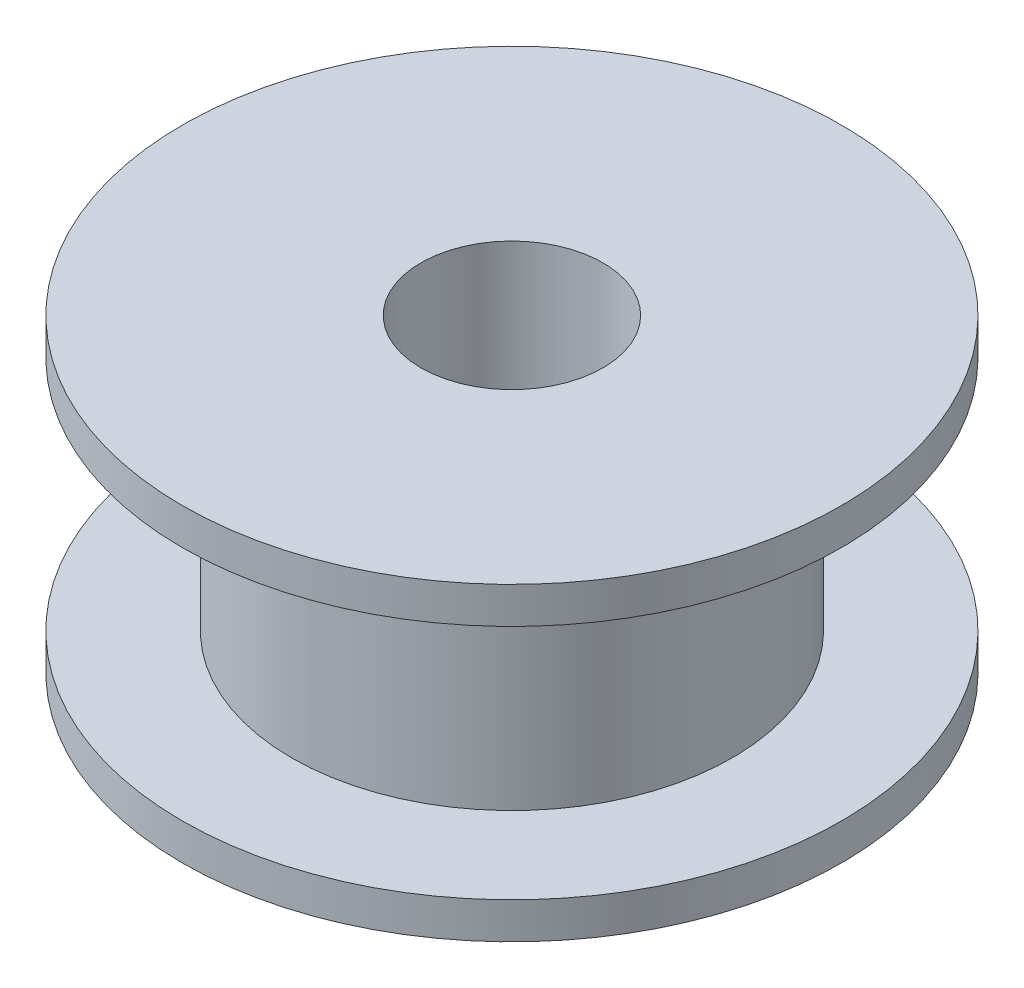
ISO-10303-21;
HEADER;
FILE_DESCRIPTION(('STEP AP214'),'2;1');
FILE_NAME('part.step','',(''),(''),'','','');
FILE_SCHEMA(('AUTOMOTIVE_DESIGN { 1 0 10303 214 1 1 1 1 }'));
ENDSEC;
DATA;
#1=APPLICATION_CONTEXT('core data for automotive mechanical design processes');
#2=APPLICATION_PROTOCOL_DEFINITION('international standard','automotive_design',2000,#1);
#3=PRODUCT_CONTEXT('',#1,'mechanical');
#4=PRODUCT('Part','Part','',(#3));
#5=PRODUCT_RELATED_PRODUCT_CATEGORY('part','',(#4));
#6=PRODUCT_DEFINITION_FORMATION('','',#4);
#7=PRODUCT_DEFINITION_CONTEXT('part definition',#1,'design');
#8=PRODUCT_DEFINITION('design','',#6,#7);
#9=PRODUCT_DEFINITION_SHAPE('','',#8);
#10=(LENGTH_UNIT() NAMED_UNIT(*) SI_UNIT(.MILLI.,.METRE.));
#11=(NAMED_UNIT(*) PLANE_ANGLE_UNIT() SI_UNIT($,.RADIAN.));
#12=(NAMED_UNIT(*) SI_UNIT($,.STERADIAN.) SOLID_ANGLE_UNIT());
#13=UNCERTAINTY_MEASURE_WITH_UNIT(LENGTH_MEASURE(1.E-05),#10,'distance_accuracy_value','');
#14=(GEOMETRIC_REPRESENTATION_CONTEXT(3) GLOBAL_UNCERTAINTY_ASSIGNED_CONTEXT((#13)) GLOBAL_UNIT_ASSIGNED_CONTEXT((#10,
#11,#12)) REPRESENTATION_CONTEXT('',''));
#15=CARTESIAN_POINT('',(0.,0.,0.));
#16=DIRECTION('',(0.,0.,1.));
#17=DIRECTION('',(1.,0.,0.));
#18=AXIS2_PLACEMENT_3D('',#15,#16,#17);
#19=CARTESIAN_POINT('',(0.,1.,0.));
#20=DIRECTION('',(0.,1.,0.));
#21=DIRECTION('',(0.,0.,1.));
#22=AXIS2_PLACEMENT_3D('',#19,#20,#21);
#23=PLANE('',#22);
#24=CARTESIAN_POINT('',(0.,1.,0.));
#25=DIRECTION('',(0.,1.,0.));
#26=DIRECTION('',(0.,0.,1.));
#27=AXIS2_PLACEMENT_3D('',#24,#25,#26);
#28=CIRCLE('',#27,9.05);
#29=CARTESIAN_POINT('',(0.,1.,9.05));
#30=VERTEX_POINT('',#29);
#31=EDGE_CURVE('E11',#30,#30,#28,.T.);
#32=ORIENTED_EDGE('',*,*,#31,.T.);
#33=EDGE_LOOP('',(#32));
#34=FACE_BOUND('',#33,.T.);
#35=CARTESIAN_POINT('',(0.,1.,0.));
#36=DIRECTION('',(0.,1.,0.));
#37=DIRECTION('',(0.,0.,1.));
#38=AXIS2_PLACEMENT_3D('',#35,#36,#37);
#39=CIRCLE('',#38,6.05);
#40=CARTESIAN_POINT('',(0.,1.,6.05));
#41=VERTEX_POINT('',#40);
#42=EDGE_CURVE('E63',#41,#41,#39,.T.);
#43=ORIENTED_EDGE('',*,*,#42,.F.);
#44=EDGE_LOOP('',(#43));
#45=FACE_BOUND('',#44,.T.);
#46=ADVANCED_FACE('F47',(#34,#45),#23,.T.);
#47=CARTESIAN_POINT('',(0.,1.,0.));
#48=DIRECTION('',(0.,-1.,0.));
#49=DIRECTION('',(0.,0.,-1.));
#50=AXIS2_PLACEMENT_3D('',#47,#48,#49);
#51=CYLINDRICAL_SURFACE('',#50,9.05);
#52=ORIENTED_EDGE('',*,*,#31,.F.);
#53=EDGE_LOOP('',(#52));
#54=FACE_BOUND('',#53,.T.);
#55=CARTESIAN_POINT('',(0.,0.,0.));
#56=DIRECTION('',(0.,1.,0.));
#57=DIRECTION('',(0.,0.,1.));
#58=AXIS2_PLACEMENT_3D('',#55,#56,#57);
#59=CIRCLE('',#58,9.05);
#60=CARTESIAN_POINT('',(0.,0.,9.05));
#61=VERTEX_POINT('',#60);
#62=EDGE_CURVE('E61',#61,#61,#59,.T.);
#63=ORIENTED_EDGE('',*,*,#62,.T.);
#64=EDGE_LOOP('',(#63));
#65=FACE_BOUND('',#64,.T.);
#66=ADVANCED_FACE('F49',(#54,#65),#51,.T.);
#67=CARTESIAN_POINT('',(0.,1.,0.));
#68=DIRECTION('',(0.,-1.,0.));
#69=DIRECTION('',(0.,0.,-1.));
#70=AXIS2_PLACEMENT_3D('',#67,#68,#69);
#71=CYLINDRICAL_SURFACE('',#70,2.5);
#72=CARTESIAN_POINT('',(0.,0.,0.));
#73=DIRECTION('',(0.,1.,0.));
#74=DIRECTION('',(0.,0.,1.));
#75=AXIS2_PLACEMENT_3D('',#72,#73,#74);
#76=CIRCLE('',#75,2.5);
#77=CARTESIAN_POINT('',(0.,0.,2.5));
#78=VERTEX_POINT('',#77);
#79=EDGE_CURVE('E51',#78,#78,#76,.T.);
#80=ORIENTED_EDGE('',*,*,#79,.F.);
#81=EDGE_LOOP('',(#80));
#82=FACE_BOUND('',#81,.T.);
#83=CARTESIAN_POINT('',(0.,8.5,0.));
#84=DIRECTION('',(0.,1.,0.));
#85=DIRECTION('',(0.,0.,1.));
#86=AXIS2_PLACEMENT_3D('',#83,#84,#85);
#87=CIRCLE('',#86,2.5);
#88=CARTESIAN_POINT('',(0.,8.5,2.5));
#89=VERTEX_POINT('',#88);
#90=EDGE_CURVE('E76',#89,#89,#87,.T.);
#91=ORIENTED_EDGE('',*,*,#90,.T.);
#92=EDGE_LOOP('',(#91));
#93=FACE_BOUND('',#92,.T.);
#94=ADVANCED_FACE('F107',(#82,#93),#71,.F.);
#95=CARTESIAN_POINT('',(0.,0.,0.));
#96=DIRECTION('',(0.,1.,0.));
#97=DIRECTION('',(0.,0.,1.));
#98=AXIS2_PLACEMENT_3D('',#95,#96,#97);
#99=PLANE('',#98);
#100=ORIENTED_EDGE('',*,*,#62,.F.);
#101=EDGE_LOOP('',(#100));
#102=FACE_BOUND('',#101,.T.);
#103=ORIENTED_EDGE('',*,*,#79,.T.);
#104=EDGE_LOOP('',(#103));
#105=FACE_BOUND('',#104,.T.);
#106=ADVANCED_FACE('F98',(#102,#105),#99,.F.);
#107=CARTESIAN_POINT('',(0.,4.25,0.));
#108=DIRECTION('',(0.,-1.,0.));
#109=DIRECTION('',(0.,0.,-1.));
#110=AXIS2_PLACEMENT_3D('',#107,#108,#109);
#111=CYLINDRICAL_SURFACE('',#110,6.05);
#112=ORIENTED_EDGE('',*,*,#42,.T.);
#113=EDGE_LOOP('',(#112));
#114=FACE_BOUND('',#113,.T.);
#115=CARTESIAN_POINT('',(0.,7.5,0.));
#116=DIRECTION('',(0.,1.,0.));
#117=DIRECTION('',(0.,0.,1.));
#118=AXIS2_PLACEMENT_3D('',#115,#116,#117);
#119=CIRCLE('',#118,6.05);
#120=CARTESIAN_POINT('',(0.,7.5,6.05));
#121=VERTEX_POINT('',#120);
#122=EDGE_CURVE('E85',#121,#121,#119,.T.);
#123=ORIENTED_EDGE('',*,*,#122,.F.);
#124=EDGE_LOOP('',(#123));
#125=FACE_BOUND('',#124,.T.);
#126=ADVANCED_FACE('F96',(#114,#125),#111,.T.);
#127=CARTESIAN_POINT('',(0.,7.5,0.));
#128=DIRECTION('',(0.,-1.,0.));
#129=DIRECTION('',(0.,0.,1.));
#130=AXIS2_PLACEMENT_3D('',#127,#128,#129);
#131=PLANE('',#130);
#132=CARTESIAN_POINT('',(0.,7.5,0.));
#133=DIRECTION('',(0.,1.,0.));
#134=DIRECTION('',(0.,0.,1.));
#135=AXIS2_PLACEMENT_3D('',#132,#133,#134);
#136=CIRCLE('',#135,9.05);
#137=CARTESIAN_POINT('',(0.,7.5,9.05));
#138=VERTEX_POINT('',#137);
#139=EDGE_CURVE('E71',#138,#138,#136,.T.);
#140=ORIENTED_EDGE('',*,*,#139,.F.);
#141=EDGE_LOOP('',(#140));
#142=FACE_BOUND('',#141,.T.);
#143=ORIENTED_EDGE('',*,*,#122,.T.);
#144=EDGE_LOOP('',(#143));
#145=FACE_BOUND('',#144,.T.);
#146=ADVANCED_FACE('F94',(#142,#145),#131,.T.);
#147=CARTESIAN_POINT('',(0.,7.5,0.));
#148=DIRECTION('',(0.,1.,0.));
#149=DIRECTION('',(0.,0.,-1.));
#150=AXIS2_PLACEMENT_3D('',#147,#148,#149);
#151=CYLINDRICAL_SURFACE('',#150,9.05);
#152=ORIENTED_EDGE('',*,*,#139,.T.);
#153=EDGE_LOOP('',(#152));
#154=FACE_BOUND('',#153,.T.);
#155=CARTESIAN_POINT('',(0.,8.5,0.));
#156=DIRECTION('',(0.,1.,0.));
#157=DIRECTION('',(0.,0.,1.));
#158=AXIS2_PLACEMENT_3D('',#155,#156,#157);
#159=CIRCLE('',#158,9.05);
#160=CARTESIAN_POINT('',(0.,8.5,9.05));
#161=VERTEX_POINT('',#160);
#162=EDGE_CURVE('E82',#161,#161,#159,.T.);
#163=ORIENTED_EDGE('',*,*,#162,.F.);
#164=EDGE_LOOP('',(#163));
#165=FACE_BOUND('',#164,.T.);
#166=ADVANCED_FACE('F104',(#154,#165),#151,.T.);
#167=CARTESIAN_POINT('',(0.,8.5,0.));
#168=DIRECTION('',(0.,-1.,0.));
#169=DIRECTION('',(0.,0.,1.));
#170=AXIS2_PLACEMENT_3D('',#167,#168,#169);
#171=PLANE('',#170);
#172=ORIENTED_EDGE('',*,*,#162,.T.);
#173=EDGE_LOOP('',(#172));
#174=FACE_BOUND('',#173,.T.);
#175=ORIENTED_EDGE('',*,*,#90,.F.);
#176=EDGE_LOOP('',(#175));
#177=FACE_BOUND('',#176,.T.);
#178=ADVANCED_FACE('F126',(#174,#177),#171,.F.);
#179=CLOSED_SHELL('',(#46,#66,#94,#106,#126,#146,#166,#178));
#180=MANIFOLD_SOLID_BREP('B2',#179);
#181=ADVANCED_BREP_SHAPE_REPRESENTATION('',(#18,#180),#14);
#182=SHAPE_DEFINITION_REPRESENTATION(#9,#181);
ENDSEC;
END-ISO-10303-21;
